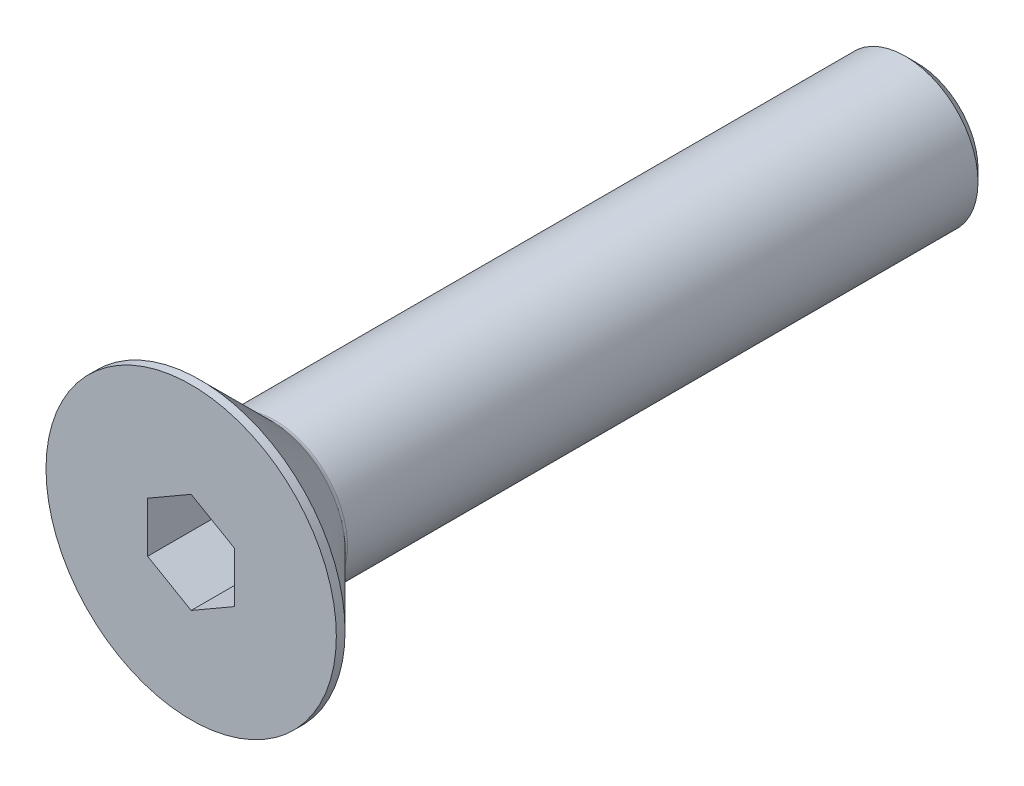
ISO-10303-21;
HEADER;
FILE_DESCRIPTION(('STEP AP214'),'2;1');
FILE_NAME('part.step','',(''),(''),'','','');
FILE_SCHEMA(('AUTOMOTIVE_DESIGN { 1 0 10303 214 1 1 1 1 }'));
ENDSEC;
DATA;
#1=APPLICATION_CONTEXT('core data for automotive mechanical design processes');
#2=APPLICATION_PROTOCOL_DEFINITION('international standard','automotive_design',2000,#1);
#3=PRODUCT_CONTEXT('',#1,'mechanical');
#4=PRODUCT('Part','Part','',(#3));
#5=PRODUCT_RELATED_PRODUCT_CATEGORY('part','',(#4));
#6=PRODUCT_DEFINITION_FORMATION('','',#4);
#7=PRODUCT_DEFINITION_CONTEXT('part definition',#1,'design');
#8=PRODUCT_DEFINITION('design','',#6,#7);
#9=PRODUCT_DEFINITION_SHAPE('','',#8);
#10=(LENGTH_UNIT() NAMED_UNIT(*) SI_UNIT(.MILLI.,.METRE.));
#11=(NAMED_UNIT(*) PLANE_ANGLE_UNIT() SI_UNIT($,.RADIAN.));
#12=(NAMED_UNIT(*) SI_UNIT($,.STERADIAN.) SOLID_ANGLE_UNIT());
#13=UNCERTAINTY_MEASURE_WITH_UNIT(LENGTH_MEASURE(1.E-05),#10,'distance_accuracy_value','');
#14=(GEOMETRIC_REPRESENTATION_CONTEXT(3) GLOBAL_UNCERTAINTY_ASSIGNED_CONTEXT((#13)) GLOBAL_UNIT_ASSIGNED_CONTEXT((#10,
#11,#12)) REPRESENTATION_CONTEXT('',''));
#15=CARTESIAN_POINT('',(0.,0.,0.));
#16=DIRECTION('',(0.,0.,1.));
#17=DIRECTION('',(1.,0.,0.));
#18=AXIS2_PLACEMENT_3D('',#15,#16,#17);
#19=CARTESIAN_POINT('',(0.,1.73205080756888,0.));
#20=DIRECTION('',(-0.5,0.866025403784439,0.));
#21=DIRECTION('',(-0.866025403784439,-0.5,0.));
#22=AXIS2_PLACEMENT_3D('',#19,#20,#21);
#23=PLANE('',#22);
#24=DIRECTION('',(0.,0.,1.));
#25=VECTOR('',#24,1.);
#26=CARTESIAN_POINT('',(0.,1.73205080756888,0.));
#27=LINE('',#26,#25);
#28=CARTESIAN_POINT('',(0.,1.73205080756888,-2.3));
#29=VERTEX_POINT('',#28);
#30=CARTESIAN_POINT('',(0.,1.73205080756888,0.));
#31=VERTEX_POINT('',#30);
#32=EDGE_CURVE('E81',#29,#31,#27,.T.);
#33=ORIENTED_EDGE('',*,*,#32,.T.);
#34=DIRECTION('',(-0.866025403784439,-0.5,0.));
#35=VECTOR('',#34,1.);
#36=CARTESIAN_POINT('',(0.,1.73205080756888,0.));
#37=LINE('',#36,#35);
#38=CARTESIAN_POINT('',(-1.5,0.866025403784439,0.));
#39=VERTEX_POINT('',#38);
#40=EDGE_CURVE('E70',#39,#31,#37,.F.);
#41=ORIENTED_EDGE('',*,*,#40,.F.);
#42=DIRECTION('',(0.,0.,1.));
#43=VECTOR('',#42,1.);
#44=CARTESIAN_POINT('',(-1.5,0.866025403784439,0.));
#45=LINE('',#44,#43);
#46=CARTESIAN_POINT('',(-1.5,0.866025403784439,-2.3));
#47=VERTEX_POINT('',#46);
#48=EDGE_CURVE('E137',#39,#47,#45,.F.);
#49=ORIENTED_EDGE('',*,*,#48,.T.);
#50=DIRECTION('',(-0.866025403784439,-0.5,0.));
#51=VECTOR('',#50,1.);
#52=CARTESIAN_POINT('',(0.,1.73205080756888,-2.3));
#53=LINE('',#52,#51);
#54=EDGE_CURVE('E66',#29,#47,#53,.T.);
#55=ORIENTED_EDGE('',*,*,#54,.F.);
#56=EDGE_LOOP('',(#33,#41,#49,#55));
#57=FACE_BOUND('',#56,.T.);
#58=ADVANCED_FACE('F15',(#57),#23,.F.);
#59=CARTESIAN_POINT('',(1.5,0.86602540378444,0.));
#60=DIRECTION('',(0.499999999999999,0.866025403784439,0.));
#61=DIRECTION('',(-0.866025403784439,0.499999999999999,0.));
#62=AXIS2_PLACEMENT_3D('',#59,#60,#61);
#63=PLANE('',#62);
#64=DIRECTION('',(0.,0.,-1.));
#65=VECTOR('',#64,1.);
#66=CARTESIAN_POINT('',(1.5,0.86602540378444,0.));
#67=LINE('',#66,#65);
#68=CARTESIAN_POINT('',(1.5,0.86602540378444,-2.3));
#69=VERTEX_POINT('',#68);
#70=CARTESIAN_POINT('',(1.5,0.86602540378444,0.));
#71=VERTEX_POINT('',#70);
#72=EDGE_CURVE('E86',#69,#71,#67,.F.);
#73=ORIENTED_EDGE('',*,*,#72,.T.);
#74=DIRECTION('',(-0.866025403784439,0.499999999999999,0.));
#75=VECTOR('',#74,1.);
#76=CARTESIAN_POINT('',(1.5,0.86602540378444,0.));
#77=LINE('',#76,#75);
#78=EDGE_CURVE('E74',#31,#71,#77,.F.);
#79=ORIENTED_EDGE('',*,*,#78,.F.);
#80=ORIENTED_EDGE('',*,*,#32,.F.);
#81=DIRECTION('',(-0.866025403784439,0.499999999999999,0.));
#82=VECTOR('',#81,1.);
#83=CARTESIAN_POINT('',(1.5,0.86602540378444,-2.3));
#84=LINE('',#83,#82);
#85=EDGE_CURVE('E87',#69,#29,#84,.T.);
#86=ORIENTED_EDGE('',*,*,#85,.F.);
#87=EDGE_LOOP('',(#73,#79,#80,#86));
#88=FACE_BOUND('',#87,.T.);
#89=ADVANCED_FACE('F84',(#88),#63,.F.);
#90=CARTESIAN_POINT('',(-1.5,0.866025403784439,0.));
#91=DIRECTION('',(-1.,0.,0.));
#92=DIRECTION('',(0.,0.,1.));
#93=AXIS2_PLACEMENT_3D('',#90,#91,#92);
#94=PLANE('',#93);
#95=ORIENTED_EDGE('',*,*,#48,.F.);
#96=DIRECTION('',(0.,1.,0.));
#97=VECTOR('',#96,1.);
#98=CARTESIAN_POINT('',(-1.5,0.866025403784439,0.));
#99=LINE('',#98,#97);
#100=CARTESIAN_POINT('',(-1.5,-0.866025403784439,0.));
#101=VERTEX_POINT('',#100);
#102=EDGE_CURVE('E77',#101,#39,#99,.T.);
#103=ORIENTED_EDGE('',*,*,#102,.F.);
#104=DIRECTION('',(0.,0.,1.));
#105=VECTOR('',#104,1.);
#106=CARTESIAN_POINT('',(-1.5,-0.866025403784439,0.));
#107=LINE('',#106,#105);
#108=CARTESIAN_POINT('',(-1.5,-0.866025403784439,-2.3));
#109=VERTEX_POINT('',#108);
#110=EDGE_CURVE('E128',#101,#109,#107,.F.);
#111=ORIENTED_EDGE('',*,*,#110,.T.);
#112=DIRECTION('',(0.,1.,0.));
#113=VECTOR('',#112,1.);
#114=CARTESIAN_POINT('',(-1.5,0.866025403784439,-2.3));
#115=LINE('',#114,#113);
#116=EDGE_CURVE('E135',#47,#109,#115,.F.);
#117=ORIENTED_EDGE('',*,*,#116,.F.);
#118=EDGE_LOOP('',(#95,#103,#111,#117));
#119=FACE_BOUND('',#118,.T.);
#120=ADVANCED_FACE('F140',(#119),#94,.F.);
#121=CARTESIAN_POINT('',(1.5,-0.866025403784439,0.));
#122=DIRECTION('',(1.,0.,0.));
#123=DIRECTION('',(0.,0.,-1.));
#124=AXIS2_PLACEMENT_3D('',#121,#122,#123);
#125=PLANE('',#124);
#126=DIRECTION('',(0.,0.,1.));
#127=VECTOR('',#126,1.);
#128=CARTESIAN_POINT('',(1.5,-0.866025403784439,0.));
#129=LINE('',#128,#127);
#130=CARTESIAN_POINT('',(1.5,-0.866025403784439,-2.3));
#131=VERTEX_POINT('',#130);
#132=CARTESIAN_POINT('',(1.5,-0.866025403784439,0.));
#133=VERTEX_POINT('',#132);
#134=EDGE_CURVE('E120',#131,#133,#129,.T.);
#135=ORIENTED_EDGE('',*,*,#134,.T.);
#136=DIRECTION('',(0.,1.,0.));
#137=VECTOR('',#136,1.);
#138=CARTESIAN_POINT('',(1.5,-0.866025403784439,0.));
#139=LINE('',#138,#137);
#140=EDGE_CURVE('E34',#71,#133,#139,.F.);
#141=ORIENTED_EDGE('',*,*,#140,.F.);
#142=ORIENTED_EDGE('',*,*,#72,.F.);
#143=DIRECTION('',(0.,1.,0.));
#144=VECTOR('',#143,1.);
#145=CARTESIAN_POINT('',(1.5,0.,-2.3));
#146=LINE('',#145,#144);
#147=EDGE_CURVE('E122',#131,#69,#146,.T.);
#148=ORIENTED_EDGE('',*,*,#147,.F.);
#149=EDGE_LOOP('',(#135,#141,#142,#148));
#150=FACE_BOUND('',#149,.T.);
#151=ADVANCED_FACE('F147',(#150),#125,.F.);
#152=CARTESIAN_POINT('',(-1.5,-0.866025403784439,0.));
#153=DIRECTION('',(-0.499999999999999,-0.866025403784439,0.));
#154=DIRECTION('',(0.866025403784439,-0.499999999999999,0.));
#155=AXIS2_PLACEMENT_3D('',#152,#153,#154);
#156=PLANE('',#155);
#157=ORIENTED_EDGE('',*,*,#110,.F.);
#158=DIRECTION('',(0.866025403784439,-0.499999999999999,0.));
#159=VECTOR('',#158,1.);
#160=CARTESIAN_POINT('',(-1.5,-0.866025403784439,0.));
#161=LINE('',#160,#159);
#162=CARTESIAN_POINT('',(0.,-1.73205080756888,0.));
#163=VERTEX_POINT('',#162);
#164=EDGE_CURVE('E131',#163,#101,#161,.F.);
#165=ORIENTED_EDGE('',*,*,#164,.F.);
#166=DIRECTION('',(0.,0.,1.));
#167=VECTOR('',#166,1.);
#168=CARTESIAN_POINT('',(0.,-1.73205080756888,0.));
#169=LINE('',#168,#167);
#170=CARTESIAN_POINT('',(0.,-1.73205080756888,-2.3));
#171=VERTEX_POINT('',#170);
#172=EDGE_CURVE('E118',#163,#171,#169,.F.);
#173=ORIENTED_EDGE('',*,*,#172,.T.);
#174=DIRECTION('',(0.866025403784439,-0.5,0.));
#175=VECTOR('',#174,1.);
#176=CARTESIAN_POINT('',(-1.5,-0.866025403784439,-2.3));
#177=LINE('',#176,#175);
#178=EDGE_CURVE('E125',#109,#171,#177,.T.);
#179=ORIENTED_EDGE('',*,*,#178,.F.);
#180=EDGE_LOOP('',(#157,#165,#173,#179));
#181=FACE_BOUND('',#180,.T.);
#182=ADVANCED_FACE('F154',(#181),#156,.F.);
#183=CARTESIAN_POINT('',(0.,0.,-2.3));
#184=DIRECTION('',(0.,0.,1.));
#185=DIRECTION('',(1.,0.,0.));
#186=AXIS2_PLACEMENT_3D('',#183,#184,#185);
#187=PLANE('',#186);
#188=ORIENTED_EDGE('',*,*,#54,.T.);
#189=ORIENTED_EDGE('',*,*,#116,.T.);
#190=ORIENTED_EDGE('',*,*,#178,.T.);
#191=DIRECTION('',(0.866025403784439,0.5,0.));
#192=VECTOR('',#191,1.);
#193=CARTESIAN_POINT('',(0.,-1.73205080756888,-2.3));
#194=LINE('',#193,#192);
#195=EDGE_CURVE('E115',#171,#131,#194,.T.);
#196=ORIENTED_EDGE('',*,*,#195,.T.);
#197=ORIENTED_EDGE('',*,*,#147,.T.);
#198=ORIENTED_EDGE('',*,*,#85,.T.);
#199=EDGE_LOOP('',(#188,#189,#190,#196,#197,#198));
#200=FACE_BOUND('',#199,.T.);
#201=ADVANCED_FACE('F144',(#200),#187,.T.);
#202=CARTESIAN_POINT('',(0.,-1.73205080756888,0.));
#203=DIRECTION('',(0.5,-0.866025403784439,0.));
#204=DIRECTION('',(0.866025403784439,0.5,0.));
#205=AXIS2_PLACEMENT_3D('',#202,#203,#204);
#206=PLANE('',#205);
#207=ORIENTED_EDGE('',*,*,#172,.F.);
#208=DIRECTION('',(-0.866025403784439,-0.5,0.));
#209=VECTOR('',#208,1.);
#210=CARTESIAN_POINT('',(1.5,-0.866025403784439,0.));
#211=LINE('',#210,#209);
#212=EDGE_CURVE('E113',#133,#163,#211,.T.);
#213=ORIENTED_EDGE('',*,*,#212,.F.);
#214=ORIENTED_EDGE('',*,*,#134,.F.);
#215=ORIENTED_EDGE('',*,*,#195,.F.);
#216=EDGE_LOOP('',(#207,#213,#214,#215));
#217=FACE_BOUND('',#216,.T.);
#218=ADVANCED_FACE('F152',(#217),#206,.F.);
#219=CARTESIAN_POINT('',(2.5,0.,0.));
#220=DIRECTION('',(0.,0.,1.));
#221=DIRECTION('',(1.,0.,0.));
#222=AXIS2_PLACEMENT_3D('',#219,#220,#221);
#223=PLANE('',#222);
#224=ORIENTED_EDGE('',*,*,#140,.T.);
#225=ORIENTED_EDGE('',*,*,#212,.T.);
#226=ORIENTED_EDGE('',*,*,#164,.T.);
#227=ORIENTED_EDGE('',*,*,#102,.T.);
#228=ORIENTED_EDGE('',*,*,#40,.T.);
#229=ORIENTED_EDGE('',*,*,#78,.T.);
#230=EDGE_LOOP('',(#224,#225,#226,#227,#228,#229));
#231=FACE_BOUND('',#230,.T.);
#232=CARTESIAN_POINT('',(0.,0.,0.));
#233=DIRECTION('',(0.,0.,-1.));
#234=DIRECTION('',(-1.,0.,0.));
#235=AXIS2_PLACEMENT_3D('',#232,#233,#234);
#236=CIRCLE('',#235,5.);
#237=CARTESIAN_POINT('',(-5.,0.,0.));
#238=VERTEX_POINT('',#237);
#239=EDGE_CURVE('E19',#238,#238,#236,.T.);
#240=ORIENTED_EDGE('',*,*,#239,.F.);
#241=EDGE_LOOP('',(#240));
#242=FACE_BOUND('',#241,.T.);
#243=ADVANCED_FACE('F71',(#231,#242),#223,.T.);
#244=CARTESIAN_POINT('',(0.,0.,-0.150000000000001));
#245=DIRECTION('',(0.,0.,-1.));
#246=DIRECTION('',(-1.,0.,0.));
#247=AXIS2_PLACEMENT_3D('',#244,#245,#246);
#248=CYLINDRICAL_SURFACE('',#247,5.);
#249=ORIENTED_EDGE('',*,*,#239,.T.);
#250=EDGE_LOOP('',(#249));
#251=FACE_BOUND('',#250,.T.);
#252=CARTESIAN_POINT('',(0.,0.,-0.299999998844669));
#253=DIRECTION('',(0.,0.,1.));
#254=DIRECTION('',(1.,0.,0.));
#255=AXIS2_PLACEMENT_3D('',#252,#253,#254);
#256=CIRCLE('',#255,4.99999999891543);
#257=CARTESIAN_POINT('',(4.99999999891543,0.,-0.299999998844669));
#258=VERTEX_POINT('',#257);
#259=EDGE_CURVE('E100',#258,#258,#256,.F.);
#260=ORIENTED_EDGE('',*,*,#259,.F.);
#261=EDGE_LOOP('',(#260));
#262=FACE_BOUND('',#261,.T.);
#263=ADVANCED_FACE('F183',(#251,#262),#248,.T.);
#264=CARTESIAN_POINT('',(0.,0.,-0.299999998844669));
#265=DIRECTION('',(0.,0.,1.));
#266=DIRECTION('',(1.,0.,0.));
#267=AXIS2_PLACEMENT_3D('',#264,#265,#266);
#268=CONICAL_SURFACE('',#267,4.99999999891543,0.785398162501056);
#269=CARTESIAN_POINT('',(0.,0.,-2.74142135623731));
#270=DIRECTION('',(0.,0.,-1.));
#271=DIRECTION('',(-1.,0.,0.));
#272=AXIS2_PLACEMENT_3D('',#269,#270,#271);
#273=CIRCLE('',#272,2.55857864376269);
#274=CARTESIAN_POINT('',(-2.55857864376269,0.,-2.74142135623731));
#275=VERTEX_POINT('',#274);
#276=EDGE_CURVE('E94',#275,#275,#273,.T.);
#277=ORIENTED_EDGE('',*,*,#276,.F.);
#278=EDGE_LOOP('',(#277));
#279=FACE_BOUND('',#278,.T.);
#280=ORIENTED_EDGE('',*,*,#259,.T.);
#281=EDGE_LOOP('',(#280));
#282=FACE_BOUND('',#281,.T.);
#283=ADVANCED_FACE('F179',(#279,#282),#268,.T.);
#284=CARTESIAN_POINT('',(1.25,0.,-25.));
#285=DIRECTION('',(0.,0.,-1.));
#286=DIRECTION('',(-1.,0.,0.));
#287=AXIS2_PLACEMENT_3D('',#284,#285,#286);
#288=PLANE('',#287);
#289=CARTESIAN_POINT('',(0.,0.,-25.0000000002046));
#290=DIRECTION('',(0.,0.,1.));
#291=DIRECTION('',(1.,0.,0.));
#292=AXIS2_PLACEMENT_3D('',#289,#290,#291);
#293=CIRCLE('',#292,2.10000000015498);
#294=CARTESIAN_POINT('',(2.10000000015498,0.,-25.0000000002046));
#295=VERTEX_POINT('',#294);
#296=EDGE_CURVE('E92',#295,#295,#293,.T.);
#297=ORIENTED_EDGE('',*,*,#296,.F.);
#298=EDGE_LOOP('',(#297));
#299=FACE_BOUND('',#298,.T.);
#300=ADVANCED_FACE('F176',(#299),#288,.T.);
#301=CARTESIAN_POINT('',(0.,0.,-2.88284271247462));
#302=DIRECTION('',(0.,0.,-1.));
#303=DIRECTION('',(-1.,0.,0.));
#304=AXIS2_PLACEMENT_3D('',#301,#302,#303);
#305=TOROIDAL_SURFACE('',#304,2.7,0.200000000000001);
#306=CARTESIAN_POINT('',(0.,0.,-2.88284271247462));
#307=DIRECTION('',(0.,0.,-1.));
#308=DIRECTION('',(-1.,0.,0.));
#309=AXIS2_PLACEMENT_3D('',#306,#307,#308);
#310=CIRCLE('',#309,2.5);
#311=CARTESIAN_POINT('',(-2.5,0.,-2.88284271247462));
#312=VERTEX_POINT('',#311);
#313=EDGE_CURVE('E25',#312,#312,#310,.T.);
#314=ORIENTED_EDGE('',*,*,#313,.F.);
#315=EDGE_LOOP('',(#314));
#316=FACE_BOUND('',#315,.T.);
#317=ORIENTED_EDGE('',*,*,#276,.T.);
#318=EDGE_LOOP('',(#317));
#319=FACE_BOUND('',#318,.T.);
#320=ADVANCED_FACE('F17',(#316,#319),#305,.F.);
#321=CARTESIAN_POINT('',(0.,0.,-24.599999999964));
#322=DIRECTION('',(0.,0.,1.));
#323=DIRECTION('',(1.,0.,0.));
#324=AXIS2_PLACEMENT_3D('',#321,#322,#323);
#325=CONICAL_SURFACE('',#324,2.49999999971351,0.785398162544797);
#326=ORIENTED_EDGE('',*,*,#296,.T.);
#327=EDGE_LOOP('',(#326));
#328=FACE_BOUND('',#327,.T.);
#329=CARTESIAN_POINT('',(0.,0.,-24.6));
#330=DIRECTION('',(0.,0.,-1.));
#331=DIRECTION('',(-1.,0.,0.));
#332=AXIS2_PLACEMENT_3D('',#329,#330,#331);
#333=CIRCLE('',#332,2.5);
#334=CARTESIAN_POINT('',(-2.5,0.,-24.6));
#335=VERTEX_POINT('',#334);
#336=EDGE_CURVE('E10',#335,#335,#333,.F.);
#337=ORIENTED_EDGE('',*,*,#336,.F.);
#338=EDGE_LOOP('',(#337));
#339=FACE_BOUND('',#338,.T.);
#340=ADVANCED_FACE('F166',(#328,#339),#325,.T.);
#341=CARTESIAN_POINT('',(0.,0.,-13.9));
#342=DIRECTION('',(0.,0.,-1.));
#343=DIRECTION('',(-1.,0.,0.));
#344=AXIS2_PLACEMENT_3D('',#341,#342,#343);
#345=CYLINDRICAL_SURFACE('',#344,2.5);
#346=ORIENTED_EDGE('',*,*,#336,.T.);
#347=EDGE_LOOP('',(#346));
#348=FACE_BOUND('',#347,.T.);
#349=ORIENTED_EDGE('',*,*,#313,.T.);
#350=EDGE_LOOP('',(#349));
#351=FACE_BOUND('',#350,.T.);
#352=ADVANCED_FACE('F164',(#348,#351),#345,.T.);
#353=CLOSED_SHELL('',(#58,#89,#120,#151,#182,#201,#218,#243,#263,#283,#300,#320,#340,#352));
#354=MANIFOLD_SOLID_BREP('B1',#353);
#355=ADVANCED_BREP_SHAPE_REPRESENTATION('',(#18,#354),#14);
#356=SHAPE_DEFINITION_REPRESENTATION(#9,#355);
ENDSEC;
END-ISO-10303-21;
